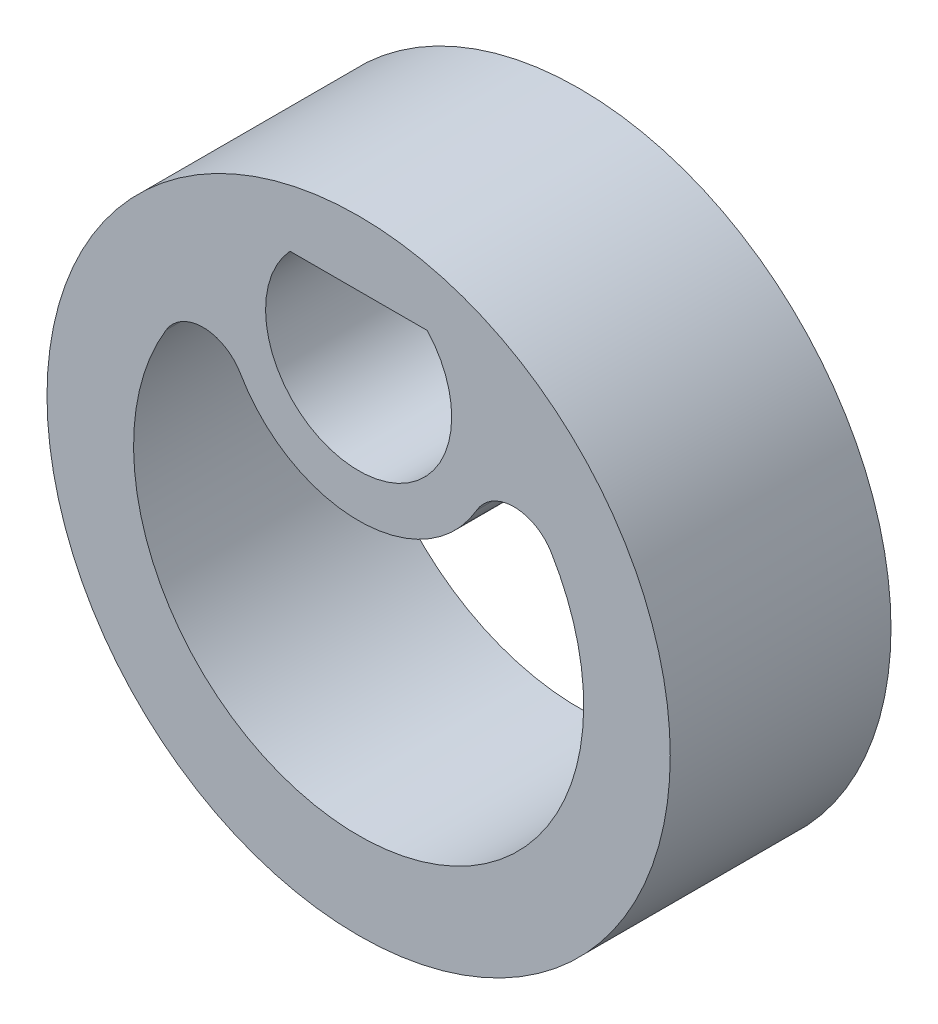
ISO-10303-21;
HEADER;
FILE_DESCRIPTION(('STEP AP214'),'2;1');
FILE_NAME('part.step','',(''),(''),'','','');
FILE_SCHEMA(('AUTOMOTIVE_DESIGN { 1 0 10303 214 1 1 1 1 }'));
ENDSEC;
DATA;
#1=APPLICATION_CONTEXT('core data for automotive mechanical design processes');
#2=APPLICATION_PROTOCOL_DEFINITION('international standard','automotive_design',2000,#1);
#3=PRODUCT_CONTEXT('',#1,'mechanical');
#4=PRODUCT('Part','Part','',(#3));
#5=PRODUCT_RELATED_PRODUCT_CATEGORY('part','',(#4));
#6=PRODUCT_DEFINITION_FORMATION('','',#4);
#7=PRODUCT_DEFINITION_CONTEXT('part definition',#1,'design');
#8=PRODUCT_DEFINITION('design','',#6,#7);
#9=PRODUCT_DEFINITION_SHAPE('','',#8);
#10=(LENGTH_UNIT() NAMED_UNIT(*) SI_UNIT(.MILLI.,.METRE.));
#11=(NAMED_UNIT(*) PLANE_ANGLE_UNIT() SI_UNIT($,.RADIAN.));
#12=(NAMED_UNIT(*) SI_UNIT($,.STERADIAN.) SOLID_ANGLE_UNIT());
#13=UNCERTAINTY_MEASURE_WITH_UNIT(LENGTH_MEASURE(1.E-05),#10,'distance_accuracy_value','');
#14=(GEOMETRIC_REPRESENTATION_CONTEXT(3) GLOBAL_UNCERTAINTY_ASSIGNED_CONTEXT((#13)) GLOBAL_UNIT_ASSIGNED_CONTEXT((#10,
#11,#12)) REPRESENTATION_CONTEXT('',''));
#15=CARTESIAN_POINT('',(0.,0.,0.));
#16=DIRECTION('',(0.,0.,1.));
#17=DIRECTION('',(1.,0.,0.));
#18=AXIS2_PLACEMENT_3D('',#15,#16,#17);
#19=CARTESIAN_POINT('',(0.,-4.25,5.1));
#20=DIRECTION('',(0.,0.,1.));
#21=DIRECTION('',(1.,0.,0.));
#22=AXIS2_PLACEMENT_3D('',#19,#20,#21);
#23=PLANE('',#22);
#24=DIRECTION('',(1.,0.,0.));
#25=VECTOR('',#24,1.);
#26=CARTESIAN_POINT('',(0.,1.45,5.1));
#27=LINE('',#26,#25);
#28=CARTESIAN_POINT('',(-1.58745078663875,1.45,5.1));
#29=VERTEX_POINT('',#28);
#30=CARTESIAN_POINT('',(1.58745078663875,1.45,5.1));
#31=VERTEX_POINT('',#30);
#32=EDGE_CURVE('E106',#29,#31,#27,.T.);
#33=ORIENTED_EDGE('',*,*,#32,.T.);
#34=CARTESIAN_POINT('',(0.,0.,5.1));
#35=DIRECTION('',(0.,0.,1.));
#36=DIRECTION('',(1.,0.,0.));
#37=AXIS2_PLACEMENT_3D('',#34,#35,#36);
#38=CIRCLE('',#37,2.15);
#39=EDGE_CURVE('E97',#29,#31,#38,.T.);
#40=ORIENTED_EDGE('',*,*,#39,.F.);
#41=EDGE_LOOP('',(#33,#40));
#42=FACE_BOUND('',#41,.T.);
#43=CARTESIAN_POINT('',(0.,-4.25,5.1));
#44=DIRECTION('',(0.,0.,1.));
#45=DIRECTION('',(1.,0.,0.));
#46=AXIS2_PLACEMENT_3D('',#43,#44,#45);
#47=CIRCLE('',#46,7.2);
#48=CARTESIAN_POINT('',(7.2,-4.25,5.1));
#49=VERTEX_POINT('',#48);
#50=EDGE_CURVE('E124',#49,#49,#47,.T.);
#51=ORIENTED_EDGE('',*,*,#50,.T.);
#52=EDGE_LOOP('',(#51));
#53=FACE_BOUND('',#52,.T.);
#54=CARTESIAN_POINT('',(0.,-4.25,5.1));
#55=DIRECTION('',(0.,0.,1.));
#56=DIRECTION('',(1.,0.,0.));
#57=AXIS2_PLACEMENT_3D('',#54,#55,#56);
#58=CIRCLE('',#57,5.2);
#59=CARTESIAN_POINT('',(-4.44909010564701,-1.55823529411765,5.1));
#60=VERTEX_POINT('',#59);
#61=CARTESIAN_POINT('',(4.44909010564701,-1.55823529411765,5.1));
#62=VERTEX_POINT('',#61);
#63=EDGE_CURVE('E154',#60,#62,#58,.T.);
#64=ORIENTED_EDGE('',*,*,#63,.F.);
#65=CARTESIAN_POINT('',(-3.59349585456104,-2.07588235294118,5.1));
#66=DIRECTION('',(0.,0.,1.));
#67=DIRECTION('',(1.,0.,0.));
#68=AXIS2_PLACEMENT_3D('',#65,#66,#67);
#69=CIRCLE('',#68,1.);
#70=CARTESIAN_POINT('',(-2.72759323900417,-1.57566973777463,5.1));
#71=VERTEX_POINT('',#70);
#72=EDGE_CURVE('E139',#60,#71,#69,.F.);
#73=ORIENTED_EDGE('',*,*,#72,.T.);
#74=CARTESIAN_POINT('',(0.,0.,5.1));
#75=DIRECTION('',(0.,0.,1.));
#76=DIRECTION('',(1.,0.,0.));
#77=AXIS2_PLACEMENT_3D('',#74,#75,#76);
#78=CIRCLE('',#77,3.15);
#79=CARTESIAN_POINT('',(2.72759323900417,-1.57566973777463,5.1));
#80=VERTEX_POINT('',#79);
#81=EDGE_CURVE('E118',#71,#80,#78,.T.);
#82=ORIENTED_EDGE('',*,*,#81,.T.);
#83=CARTESIAN_POINT('',(3.59349585456104,-2.07588235294118,5.1));
#84=DIRECTION('',(0.,0.,1.));
#85=DIRECTION('',(1.,0.,0.));
#86=AXIS2_PLACEMENT_3D('',#83,#84,#85);
#87=CIRCLE('',#86,1.);
#88=EDGE_CURVE('E11',#80,#62,#87,.F.);
#89=ORIENTED_EDGE('',*,*,#88,.T.);
#90=EDGE_LOOP('',(#64,#73,#82,#89));
#91=FACE_BOUND('',#90,.T.);
#92=ADVANCED_FACE('F43',(#42,#53,#91),#23,.T.);
#93=CARTESIAN_POINT('',(0.,-4.25,0.));
#94=DIRECTION('',(0.,0.,1.));
#95=DIRECTION('',(1.,0.,0.));
#96=AXIS2_PLACEMENT_3D('',#93,#94,#95);
#97=PLANE('',#96);
#98=CARTESIAN_POINT('',(0.,-4.25,0.));
#99=DIRECTION('',(0.,0.,1.));
#100=DIRECTION('',(1.,0.,0.));
#101=AXIS2_PLACEMENT_3D('',#98,#99,#100);
#102=CIRCLE('',#101,7.2);
#103=CARTESIAN_POINT('',(7.2,-4.25,0.));
#104=VERTEX_POINT('',#103);
#105=EDGE_CURVE('E123',#104,#104,#102,.T.);
#106=ORIENTED_EDGE('',*,*,#105,.F.);
#107=EDGE_LOOP('',(#106));
#108=FACE_BOUND('',#107,.T.);
#109=CARTESIAN_POINT('',(0.,0.,0.));
#110=DIRECTION('',(0.,0.,1.));
#111=DIRECTION('',(1.,0.,0.));
#112=AXIS2_PLACEMENT_3D('',#109,#110,#111);
#113=CIRCLE('',#112,2.15);
#114=CARTESIAN_POINT('',(-1.58745078663875,1.45,0.));
#115=VERTEX_POINT('',#114);
#116=CARTESIAN_POINT('',(1.58745078663875,1.45,0.));
#117=VERTEX_POINT('',#116);
#118=EDGE_CURVE('E114',#115,#117,#113,.T.);
#119=ORIENTED_EDGE('',*,*,#118,.T.);
#120=DIRECTION('',(1.,0.,0.));
#121=VECTOR('',#120,1.);
#122=CARTESIAN_POINT('',(0.,1.45,0.));
#123=LINE('',#122,#121);
#124=EDGE_CURVE('E111',#115,#117,#123,.T.);
#125=ORIENTED_EDGE('',*,*,#124,.F.);
#126=EDGE_LOOP('',(#119,#125));
#127=FACE_BOUND('',#126,.T.);
#128=CARTESIAN_POINT('',(0.,-4.25,0.));
#129=DIRECTION('',(0.,0.,-1.));
#130=DIRECTION('',(-1.,0.,0.));
#131=AXIS2_PLACEMENT_3D('',#128,#129,#130);
#132=CIRCLE('',#131,5.2);
#133=CARTESIAN_POINT('',(4.44909010564701,-1.55823529411765,0.));
#134=VERTEX_POINT('',#133);
#135=CARTESIAN_POINT('',(-4.44909010564701,-1.55823529411765,0.));
#136=VERTEX_POINT('',#135);
#137=EDGE_CURVE('E143',#134,#136,#132,.T.);
#138=ORIENTED_EDGE('',*,*,#137,.F.);
#139=CARTESIAN_POINT('',(3.59349585456104,-2.07588235294118,0.));
#140=DIRECTION('',(0.,0.,1.));
#141=DIRECTION('',(1.,0.,0.));
#142=AXIS2_PLACEMENT_3D('',#139,#140,#141);
#143=CIRCLE('',#142,1.);
#144=CARTESIAN_POINT('',(2.72759323900417,-1.57566973777463,0.));
#145=VERTEX_POINT('',#144);
#146=EDGE_CURVE('E51',#134,#145,#143,.T.);
#147=ORIENTED_EDGE('',*,*,#146,.T.);
#148=CARTESIAN_POINT('',(0.,0.,0.));
#149=DIRECTION('',(0.,0.,-1.));
#150=DIRECTION('',(-1.,0.,0.));
#151=AXIS2_PLACEMENT_3D('',#148,#149,#150);
#152=CIRCLE('',#151,3.15);
#153=CARTESIAN_POINT('',(-2.72759323900417,-1.57566973777463,0.));
#154=VERTEX_POINT('',#153);
#155=EDGE_CURVE('E142',#145,#154,#152,.T.);
#156=ORIENTED_EDGE('',*,*,#155,.T.);
#157=CARTESIAN_POINT('',(-3.59349585456104,-2.07588235294118,0.));
#158=DIRECTION('',(0.,0.,1.));
#159=DIRECTION('',(1.,0.,0.));
#160=AXIS2_PLACEMENT_3D('',#157,#158,#159);
#161=CIRCLE('',#160,1.);
#162=EDGE_CURVE('E58',#154,#136,#161,.T.);
#163=ORIENTED_EDGE('',*,*,#162,.T.);
#164=EDGE_LOOP('',(#138,#147,#156,#163));
#165=FACE_BOUND('',#164,.T.);
#166=ADVANCED_FACE('F141',(#108,#127,#165),#97,.F.);
#167=CARTESIAN_POINT('',(0.,-4.25,5.1));
#168=DIRECTION('',(0.,0.,-1.));
#169=DIRECTION('',(-1.,0.,0.));
#170=AXIS2_PLACEMENT_3D('',#167,#168,#169);
#171=CYLINDRICAL_SURFACE('',#170,7.2);
#172=ORIENTED_EDGE('',*,*,#50,.F.);
#173=EDGE_LOOP('',(#172));
#174=FACE_BOUND('',#173,.T.);
#175=ORIENTED_EDGE('',*,*,#105,.T.);
#176=EDGE_LOOP('',(#175));
#177=FACE_BOUND('',#176,.T.);
#178=ADVANCED_FACE('F176',(#174,#177),#171,.T.);
#179=CARTESIAN_POINT('',(0.,1.45,5.1));
#180=DIRECTION('',(0.,1.,0.));
#181=DIRECTION('',(0.,0.,1.));
#182=AXIS2_PLACEMENT_3D('',#179,#180,#181);
#183=PLANE('',#182);
#184=ORIENTED_EDGE('',*,*,#124,.T.);
#185=DIRECTION('',(0.,0.,-1.));
#186=VECTOR('',#185,1.);
#187=CARTESIAN_POINT('',(1.58745078663875,1.45,5.1));
#188=LINE('',#187,#186);
#189=EDGE_CURVE('E101',#31,#117,#188,.T.);
#190=ORIENTED_EDGE('',*,*,#189,.F.);
#191=ORIENTED_EDGE('',*,*,#32,.F.);
#192=DIRECTION('',(0.,0.,-1.));
#193=VECTOR('',#192,1.);
#194=CARTESIAN_POINT('',(-1.58745078663875,1.45,5.1));
#195=LINE('',#194,#193);
#196=EDGE_CURVE('E103',#29,#115,#195,.T.);
#197=ORIENTED_EDGE('',*,*,#196,.T.);
#198=EDGE_LOOP('',(#184,#190,#191,#197));
#199=FACE_BOUND('',#198,.T.);
#200=ADVANCED_FACE('F109',(#199),#183,.F.);
#201=CARTESIAN_POINT('',(0.,0.,5.1));
#202=DIRECTION('',(0.,0.,-1.));
#203=DIRECTION('',(-1.,0.,0.));
#204=AXIS2_PLACEMENT_3D('',#201,#202,#203);
#205=CYLINDRICAL_SURFACE('',#204,2.15);
#206=ORIENTED_EDGE('',*,*,#118,.F.);
#207=ORIENTED_EDGE('',*,*,#196,.F.);
#208=ORIENTED_EDGE('',*,*,#39,.T.);
#209=ORIENTED_EDGE('',*,*,#189,.T.);
#210=EDGE_LOOP('',(#206,#207,#208,#209));
#211=FACE_BOUND('',#210,.T.);
#212=ADVANCED_FACE('F100',(#211),#205,.F.);
#213=CARTESIAN_POINT('',(0.,0.,25.6));
#214=DIRECTION('',(0.,0.,-1.));
#215=DIRECTION('',(-1.,0.,0.));
#216=AXIS2_PLACEMENT_3D('',#213,#214,#215);
#217=CYLINDRICAL_SURFACE('',#216,3.15);
#218=ORIENTED_EDGE('',*,*,#81,.F.);
#219=DIRECTION('',(0.,0.,-1.));
#220=VECTOR('',#219,1.);
#221=CARTESIAN_POINT('',(-2.72759323900417,-1.57566973777463,25.6));
#222=LINE('',#221,#220);
#223=EDGE_CURVE('E131',#71,#154,#222,.T.);
#224=ORIENTED_EDGE('',*,*,#223,.T.);
#225=ORIENTED_EDGE('',*,*,#155,.F.);
#226=DIRECTION('',(0.,0.,-1.));
#227=VECTOR('',#226,1.);
#228=CARTESIAN_POINT('',(2.72759323900417,-1.57566973777463,25.6));
#229=LINE('',#228,#227);
#230=EDGE_CURVE('E127',#145,#80,#229,.F.);
#231=ORIENTED_EDGE('',*,*,#230,.T.);
#232=EDGE_LOOP('',(#218,#224,#225,#231));
#233=FACE_BOUND('',#232,.T.);
#234=ADVANCED_FACE('F146',(#233),#217,.T.);
#235=CARTESIAN_POINT('',(0.,-4.25,25.6));
#236=DIRECTION('',(0.,0.,-1.));
#237=DIRECTION('',(-1.,0.,0.));
#238=AXIS2_PLACEMENT_3D('',#235,#236,#237);
#239=CYLINDRICAL_SURFACE('',#238,5.2);
#240=ORIENTED_EDGE('',*,*,#137,.T.);
#241=DIRECTION('',(0.,0.,-1.));
#242=VECTOR('',#241,1.);
#243=CARTESIAN_POINT('',(-4.44909010564701,-1.55823529411765,25.6));
#244=LINE('',#243,#242);
#245=EDGE_CURVE('E136',#136,#60,#244,.F.);
#246=ORIENTED_EDGE('',*,*,#245,.T.);
#247=ORIENTED_EDGE('',*,*,#63,.T.);
#248=DIRECTION('',(0.,0.,-1.));
#249=VECTOR('',#248,1.);
#250=CARTESIAN_POINT('',(4.44909010564701,-1.55823529411765,25.6));
#251=LINE('',#250,#249);
#252=EDGE_CURVE('E134',#62,#134,#251,.T.);
#253=ORIENTED_EDGE('',*,*,#252,.T.);
#254=EDGE_LOOP('',(#240,#246,#247,#253));
#255=FACE_BOUND('',#254,.T.);
#256=ADVANCED_FACE('F157',(#255),#239,.F.);
#257=CARTESIAN_POINT('',(-3.59349585456104,-2.07588235294118,25.6));
#258=DIRECTION('',(0.,0.,-1.));
#259=DIRECTION('',(-1.,0.,0.));
#260=AXIS2_PLACEMENT_3D('',#257,#258,#259);
#261=CYLINDRICAL_SURFACE('',#260,1.);
#262=ORIENTED_EDGE('',*,*,#72,.F.);
#263=ORIENTED_EDGE('',*,*,#245,.F.);
#264=ORIENTED_EDGE('',*,*,#162,.F.);
#265=ORIENTED_EDGE('',*,*,#223,.F.);
#266=EDGE_LOOP('',(#262,#263,#264,#265));
#267=FACE_BOUND('',#266,.T.);
#268=ADVANCED_FACE('F161',(#267),#261,.F.);
#269=CARTESIAN_POINT('',(3.59349585456104,-2.07588235294118,25.6));
#270=DIRECTION('',(0.,0.,-1.));
#271=DIRECTION('',(-1.,0.,0.));
#272=AXIS2_PLACEMENT_3D('',#269,#270,#271);
#273=CYLINDRICAL_SURFACE('',#272,1.);
#274=ORIENTED_EDGE('',*,*,#88,.F.);
#275=ORIENTED_EDGE('',*,*,#230,.F.);
#276=ORIENTED_EDGE('',*,*,#146,.F.);
#277=ORIENTED_EDGE('',*,*,#252,.F.);
#278=EDGE_LOOP('',(#274,#275,#276,#277));
#279=FACE_BOUND('',#278,.T.);
#280=ADVANCED_FACE('F45',(#279),#273,.F.);
#281=CLOSED_SHELL('',(#92,#166,#178,#200,#212,#234,#256,#268,#280));
#282=MANIFOLD_SOLID_BREP('B2',#281);
#283=ADVANCED_BREP_SHAPE_REPRESENTATION('',(#18,#282),#14);
#284=SHAPE_DEFINITION_REPRESENTATION(#9,#283);
ENDSEC;
END-ISO-10303-21;
